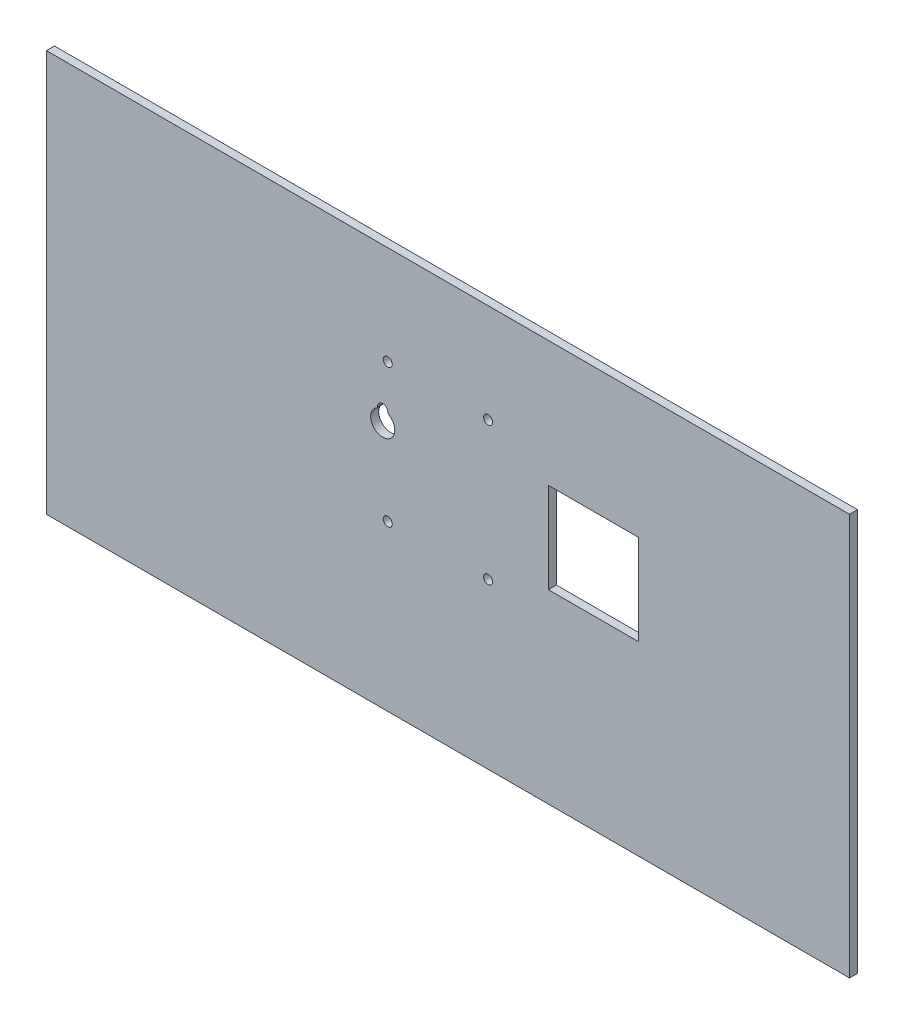
ISO-10303-21;
HEADER;
FILE_DESCRIPTION(('STEP AP214'),'2;1');
FILE_NAME('part.step','',(''),(''),'','','');
FILE_SCHEMA(('AUTOMOTIVE_DESIGN { 1 0 10303 214 1 1 1 1 }'));
ENDSEC;
DATA;
#1=APPLICATION_CONTEXT('core data for automotive mechanical design processes');
#2=APPLICATION_PROTOCOL_DEFINITION('international standard','automotive_design',2000,#1);
#3=PRODUCT_CONTEXT('',#1,'mechanical');
#4=PRODUCT('Part','Part','',(#3));
#5=PRODUCT_RELATED_PRODUCT_CATEGORY('part','',(#4));
#6=PRODUCT_DEFINITION_FORMATION('','',#4);
#7=PRODUCT_DEFINITION_CONTEXT('part definition',#1,'design');
#8=PRODUCT_DEFINITION('design','',#6,#7);
#9=PRODUCT_DEFINITION_SHAPE('','',#8);
#10=(LENGTH_UNIT() NAMED_UNIT(*) SI_UNIT(.MILLI.,.METRE.));
#11=(NAMED_UNIT(*) PLANE_ANGLE_UNIT() SI_UNIT($,.RADIAN.));
#12=(NAMED_UNIT(*) SI_UNIT($,.STERADIAN.) SOLID_ANGLE_UNIT());
#13=UNCERTAINTY_MEASURE_WITH_UNIT(LENGTH_MEASURE(1.E-05),#10,'distance_accuracy_value','');
#14=(GEOMETRIC_REPRESENTATION_CONTEXT(3) GLOBAL_UNCERTAINTY_ASSIGNED_CONTEXT((#13)) GLOBAL_UNIT_ASSIGNED_CONTEXT((#10,
#11,#12)) REPRESENTATION_CONTEXT('',''));
#15=CARTESIAN_POINT('',(0.,0.,0.));
#16=DIRECTION('',(0.,0.,1.));
#17=DIRECTION('',(1.,0.,0.));
#18=AXIS2_PLACEMENT_3D('',#15,#16,#17);
#19=CARTESIAN_POINT('',(295.,137.5,0.));
#20=DIRECTION('',(1.,0.,0.));
#21=DIRECTION('',(0.,0.,-1.));
#22=AXIS2_PLACEMENT_3D('',#19,#20,#21);
#23=PLANE('',#22);
#24=DIRECTION('',(0.,1.,0.));
#25=VECTOR('',#24,1.);
#26=CARTESIAN_POINT('',(295.,137.5,4.));
#27=LINE('',#26,#25);
#28=CARTESIAN_POINT('',(295.,92.5000000000001,4.));
#29=VERTEX_POINT('',#28);
#30=CARTESIAN_POINT('',(295.,137.5,4.));
#31=VERTEX_POINT('',#30);
#32=EDGE_CURVE('E213',#29,#31,#27,.T.);
#33=ORIENTED_EDGE('',*,*,#32,.T.);
#34=DIRECTION('',(0.,0.,1.));
#35=VECTOR('',#34,1.);
#36=CARTESIAN_POINT('',(295.,137.5,0.));
#37=LINE('',#36,#35);
#38=CARTESIAN_POINT('',(295.,137.5,0.));
#39=VERTEX_POINT('',#38);
#40=EDGE_CURVE('E229',#39,#31,#37,.T.);
#41=ORIENTED_EDGE('',*,*,#40,.F.);
#42=DIRECTION('',(0.,1.,0.));
#43=VECTOR('',#42,1.);
#44=CARTESIAN_POINT('',(295.,137.5,0.));
#45=LINE('',#44,#43);
#46=CARTESIAN_POINT('',(295.,92.5000000000001,0.));
#47=VERTEX_POINT('',#46);
#48=EDGE_CURVE('E216',#47,#39,#45,.T.);
#49=ORIENTED_EDGE('',*,*,#48,.F.);
#50=DIRECTION('',(0.,0.,1.));
#51=VECTOR('',#50,1.);
#52=CARTESIAN_POINT('',(295.,92.5000000000001,0.));
#53=LINE('',#52,#51);
#54=EDGE_CURVE('E239',#47,#29,#53,.T.);
#55=ORIENTED_EDGE('',*,*,#54,.T.);
#56=EDGE_LOOP('',(#33,#41,#49,#55));
#57=FACE_BOUND('',#56,.T.);
#58=ADVANCED_FACE('F36',(#57),#23,.F.);
#59=CARTESIAN_POINT('',(295.,92.5000000000001,0.));
#60=DIRECTION('',(0.,-1.,0.));
#61=DIRECTION('',(1.,0.,0.));
#62=AXIS2_PLACEMENT_3D('',#59,#60,#61);
#63=PLANE('',#62);
#64=DIRECTION('',(1.,0.,0.));
#65=VECTOR('',#64,1.);
#66=CARTESIAN_POINT('',(295.,92.5000000000001,4.));
#67=LINE('',#66,#65);
#68=CARTESIAN_POINT('',(250.,92.5,4.));
#69=VERTEX_POINT('',#68);
#70=EDGE_CURVE('E220',#69,#29,#67,.T.);
#71=ORIENTED_EDGE('',*,*,#70,.T.);
#72=ORIENTED_EDGE('',*,*,#54,.F.);
#73=DIRECTION('',(1.,0.,0.));
#74=VECTOR('',#73,1.);
#75=CARTESIAN_POINT('',(295.,92.5000000000001,0.));
#76=LINE('',#75,#74);
#77=CARTESIAN_POINT('',(250.,92.5,0.));
#78=VERTEX_POINT('',#77);
#79=EDGE_CURVE('E226',#78,#47,#76,.T.);
#80=ORIENTED_EDGE('',*,*,#79,.F.);
#81=DIRECTION('',(0.,0.,1.));
#82=VECTOR('',#81,1.);
#83=CARTESIAN_POINT('',(250.,92.5,0.));
#84=LINE('',#83,#82);
#85=EDGE_CURVE('E241',#78,#69,#84,.T.);
#86=ORIENTED_EDGE('',*,*,#85,.T.);
#87=EDGE_LOOP('',(#71,#72,#80,#86));
#88=FACE_BOUND('',#87,.T.);
#89=ADVANCED_FACE('F263',(#88),#63,.F.);
#90=CARTESIAN_POINT('',(250.,137.5,0.));
#91=DIRECTION('',(-1.,0.,0.));
#92=DIRECTION('',(0.,-1.,0.));
#93=AXIS2_PLACEMENT_3D('',#90,#91,#92);
#94=PLANE('',#93);
#95=DIRECTION('',(0.,-1.,0.));
#96=VECTOR('',#95,1.);
#97=CARTESIAN_POINT('',(250.,137.5,4.));
#98=LINE('',#97,#96);
#99=CARTESIAN_POINT('',(250.,137.5,4.));
#100=VERTEX_POINT('',#99);
#101=EDGE_CURVE('E234',#100,#69,#98,.T.);
#102=ORIENTED_EDGE('',*,*,#101,.T.);
#103=ORIENTED_EDGE('',*,*,#85,.F.);
#104=DIRECTION('',(0.,-1.,0.));
#105=VECTOR('',#104,1.);
#106=CARTESIAN_POINT('',(250.,137.5,0.));
#107=LINE('',#106,#105);
#108=CARTESIAN_POINT('',(250.,137.5,0.));
#109=VERTEX_POINT('',#108);
#110=EDGE_CURVE('E223',#109,#78,#107,.T.);
#111=ORIENTED_EDGE('',*,*,#110,.F.);
#112=DIRECTION('',(0.,0.,1.));
#113=VECTOR('',#112,1.);
#114=CARTESIAN_POINT('',(250.,137.5,0.));
#115=LINE('',#114,#113);
#116=EDGE_CURVE('E243',#109,#100,#115,.T.);
#117=ORIENTED_EDGE('',*,*,#116,.T.);
#118=EDGE_LOOP('',(#102,#103,#111,#117));
#119=FACE_BOUND('',#118,.T.);
#120=ADVANCED_FACE('F258',(#119),#94,.F.);
#121=CARTESIAN_POINT('',(295.,137.5,0.));
#122=DIRECTION('',(0.,1.,0.));
#123=DIRECTION('',(-1.,0.,0.));
#124=AXIS2_PLACEMENT_3D('',#121,#122,#123);
#125=PLANE('',#124);
#126=DIRECTION('',(-1.,0.,0.));
#127=VECTOR('',#126,1.);
#128=CARTESIAN_POINT('',(295.,137.5,4.));
#129=LINE('',#128,#127);
#130=EDGE_CURVE('E231',#31,#100,#129,.T.);
#131=ORIENTED_EDGE('',*,*,#130,.T.);
#132=ORIENTED_EDGE('',*,*,#116,.F.);
#133=DIRECTION('',(-1.,0.,0.));
#134=VECTOR('',#133,1.);
#135=CARTESIAN_POINT('',(295.,137.5,0.));
#136=LINE('',#135,#134);
#137=EDGE_CURVE('E219',#39,#109,#136,.T.);
#138=ORIENTED_EDGE('',*,*,#137,.F.);
#139=ORIENTED_EDGE('',*,*,#40,.T.);
#140=EDGE_LOOP('',(#131,#132,#138,#139));
#141=FACE_BOUND('',#140,.T.);
#142=ADVANCED_FACE('F249',(#141),#125,.F.);
#143=CARTESIAN_POINT('',(220.,150.75,0.));
#144=DIRECTION('',(0.,0.,1.));
#145=DIRECTION('',(1.,0.,0.));
#146=AXIS2_PLACEMENT_3D('',#143,#144,#145);
#147=CYLINDRICAL_SURFACE('',#146,2.25000000000001);
#148=CARTESIAN_POINT('',(220.,150.75,0.));
#149=DIRECTION('',(0.,0.,1.));
#150=DIRECTION('',(1.,0.,0.));
#151=AXIS2_PLACEMENT_3D('',#148,#149,#150);
#152=CIRCLE('',#151,2.25000000000001);
#153=CARTESIAN_POINT('',(222.25,150.75,0.));
#154=VERTEX_POINT('',#153);
#155=EDGE_CURVE('E210',#154,#154,#152,.T.);
#156=ORIENTED_EDGE('',*,*,#155,.F.);
#157=EDGE_LOOP('',(#156));
#158=FACE_BOUND('',#157,.T.);
#159=CARTESIAN_POINT('',(220.,150.75,4.));
#160=DIRECTION('',(0.,0.,1.));
#161=DIRECTION('',(1.,0.,0.));
#162=AXIS2_PLACEMENT_3D('',#159,#160,#161);
#163=CIRCLE('',#162,2.25000000000001);
#164=CARTESIAN_POINT('',(222.25,150.75,4.));
#165=VERTEX_POINT('',#164);
#166=EDGE_CURVE('E207',#165,#165,#163,.T.);
#167=ORIENTED_EDGE('',*,*,#166,.T.);
#168=EDGE_LOOP('',(#167));
#169=FACE_BOUND('',#168,.T.);
#170=ADVANCED_FACE('F273',(#158,#169),#147,.F.);
#171=CARTESIAN_POINT('',(170.,150.75,0.));
#172=DIRECTION('',(0.,0.,1.));
#173=DIRECTION('',(1.,0.,0.));
#174=AXIS2_PLACEMENT_3D('',#171,#172,#173);
#175=CYLINDRICAL_SURFACE('',#174,2.25);
#176=CARTESIAN_POINT('',(170.,150.75,0.));
#177=DIRECTION('',(0.,0.,1.));
#178=DIRECTION('',(1.,0.,0.));
#179=AXIS2_PLACEMENT_3D('',#176,#177,#178);
#180=CIRCLE('',#179,2.25);
#181=CARTESIAN_POINT('',(172.25,150.75,0.));
#182=VERTEX_POINT('',#181);
#183=EDGE_CURVE('E204',#182,#182,#180,.T.);
#184=ORIENTED_EDGE('',*,*,#183,.F.);
#185=EDGE_LOOP('',(#184));
#186=FACE_BOUND('',#185,.T.);
#187=CARTESIAN_POINT('',(170.,150.75,4.));
#188=DIRECTION('',(0.,0.,1.));
#189=DIRECTION('',(1.,0.,0.));
#190=AXIS2_PLACEMENT_3D('',#187,#188,#189);
#191=CIRCLE('',#190,2.25);
#192=CARTESIAN_POINT('',(172.25,150.75,4.));
#193=VERTEX_POINT('',#192);
#194=EDGE_CURVE('E201',#193,#193,#191,.T.);
#195=ORIENTED_EDGE('',*,*,#194,.T.);
#196=EDGE_LOOP('',(#195));
#197=FACE_BOUND('',#196,.T.);
#198=ADVANCED_FACE('F296',(#186,#197),#175,.F.);
#199=CARTESIAN_POINT('',(220.,81.91754989,0.));
#200=DIRECTION('',(0.,0.,1.));
#201=DIRECTION('',(1.,0.,0.));
#202=AXIS2_PLACEMENT_3D('',#199,#200,#201);
#203=CYLINDRICAL_SURFACE('',#202,2.25000000000001);
#204=CARTESIAN_POINT('',(220.,81.91754989,0.));
#205=DIRECTION('',(0.,0.,1.));
#206=DIRECTION('',(1.,0.,0.));
#207=AXIS2_PLACEMENT_3D('',#204,#205,#206);
#208=CIRCLE('',#207,2.25000000000001);
#209=CARTESIAN_POINT('',(222.25,81.91754989,0.));
#210=VERTEX_POINT('',#209);
#211=EDGE_CURVE('E198',#210,#210,#208,.T.);
#212=ORIENTED_EDGE('',*,*,#211,.F.);
#213=EDGE_LOOP('',(#212));
#214=FACE_BOUND('',#213,.T.);
#215=CARTESIAN_POINT('',(220.,81.91754989,4.));
#216=DIRECTION('',(0.,0.,1.));
#217=DIRECTION('',(1.,0.,0.));
#218=AXIS2_PLACEMENT_3D('',#215,#216,#217);
#219=CIRCLE('',#218,2.25000000000001);
#220=CARTESIAN_POINT('',(222.25,81.91754989,4.));
#221=VERTEX_POINT('',#220);
#222=EDGE_CURVE('E195',#221,#221,#219,.T.);
#223=ORIENTED_EDGE('',*,*,#222,.T.);
#224=EDGE_LOOP('',(#223));
#225=FACE_BOUND('',#224,.T.);
#226=ADVANCED_FACE('F302',(#214,#225),#203,.F.);
#227=CARTESIAN_POINT('',(170.,81.91754989,0.));
#228=DIRECTION('',(0.,0.,1.));
#229=DIRECTION('',(1.,0.,0.));
#230=AXIS2_PLACEMENT_3D('',#227,#228,#229);
#231=CYLINDRICAL_SURFACE('',#230,2.25000000000001);
#232=CARTESIAN_POINT('',(170.,81.91754989,0.));
#233=DIRECTION('',(0.,0.,1.));
#234=DIRECTION('',(1.,0.,0.));
#235=AXIS2_PLACEMENT_3D('',#232,#233,#234);
#236=CIRCLE('',#235,2.25000000000001);
#237=CARTESIAN_POINT('',(172.25,81.91754989,0.));
#238=VERTEX_POINT('',#237);
#239=EDGE_CURVE('E192',#238,#238,#236,.T.);
#240=ORIENTED_EDGE('',*,*,#239,.F.);
#241=EDGE_LOOP('',(#240));
#242=FACE_BOUND('',#241,.T.);
#243=CARTESIAN_POINT('',(170.,81.91754989,4.));
#244=DIRECTION('',(0.,0.,1.));
#245=DIRECTION('',(1.,0.,0.));
#246=AXIS2_PLACEMENT_3D('',#243,#244,#245);
#247=CIRCLE('',#246,2.25000000000001);
#248=CARTESIAN_POINT('',(172.25,81.91754989,4.));
#249=VERTEX_POINT('',#248);
#250=EDGE_CURVE('E186',#249,#249,#247,.T.);
#251=ORIENTED_EDGE('',*,*,#250,.T.);
#252=EDGE_LOOP('',(#251));
#253=FACE_BOUND('',#252,.T.);
#254=ADVANCED_FACE('F307',(#242,#253),#231,.F.);
#255=CARTESIAN_POINT('',(163.950154547818,129.033125,0.));
#256=DIRECTION('',(0.,0.,1.));
#257=DIRECTION('',(1.,0.,0.));
#258=AXIS2_PLACEMENT_3D('',#255,#256,#257);
#259=CYLINDRICAL_SURFACE('',#258,1.);
#260=CARTESIAN_POINT('',(163.950154547818,129.033125,4.));
#261=DIRECTION('',(0.,0.,-1.));
#262=DIRECTION('',(-1.,0.,0.));
#263=AXIS2_PLACEMENT_3D('',#260,#261,#262);
#264=CIRCLE('',#263,1.);
#265=CARTESIAN_POINT('',(164.950111013222,129.023794014085,4.));
#266=VERTEX_POINT('',#265);
#267=CARTESIAN_POINT('',(164.457275326701,128.17125,4.));
#268=VERTEX_POINT('',#267);
#269=EDGE_CURVE('E59',#266,#268,#264,.T.);
#270=ORIENTED_EDGE('',*,*,#269,.T.);
#271=DIRECTION('',(0.,0.,1.));
#272=VECTOR('',#271,1.);
#273=CARTESIAN_POINT('',(164.457275326701,128.17125,0.));
#274=LINE('',#273,#272);
#275=CARTESIAN_POINT('',(164.457275326701,128.17125,0.));
#276=VERTEX_POINT('',#275);
#277=EDGE_CURVE('E174',#276,#268,#274,.T.);
#278=ORIENTED_EDGE('',*,*,#277,.F.);
#279=CARTESIAN_POINT('',(163.950154547818,129.033125,0.));
#280=DIRECTION('',(0.,0.,-1.));
#281=DIRECTION('',(-1.,0.,0.));
#282=AXIS2_PLACEMENT_3D('',#279,#280,#281);
#283=CIRCLE('',#282,1.);
#284=CARTESIAN_POINT('',(164.950111013222,129.023794014085,0.));
#285=VERTEX_POINT('',#284);
#286=EDGE_CURVE('E163',#285,#276,#283,.T.);
#287=ORIENTED_EDGE('',*,*,#286,.F.);
#288=DIRECTION('',(0.,0.,1.));
#289=VECTOR('',#288,1.);
#290=CARTESIAN_POINT('',(164.950111013222,129.023794014085,0.));
#291=LINE('',#290,#289);
#292=EDGE_CURVE('E184',#285,#266,#291,.T.);
#293=ORIENTED_EDGE('',*,*,#292,.T.);
#294=EDGE_LOOP('',(#270,#278,#287,#293));
#295=FACE_BOUND('',#294,.T.);
#296=ADVANCED_FACE('F314',(#295),#259,.T.);
#297=CARTESIAN_POINT('',(167.5,129.,0.));
#298=DIRECTION('',(0.,0.,1.));
#299=DIRECTION('',(1.,0.,0.));
#300=AXIS2_PLACEMENT_3D('',#297,#298,#299);
#301=CYLINDRICAL_SURFACE('',#300,2.54999999999999);
#302=CARTESIAN_POINT('',(167.5,129.,4.));
#303=DIRECTION('',(0.,0.,1.));
#304=DIRECTION('',(1.,0.,0.));
#305=AXIS2_PLACEMENT_3D('',#302,#303,#304);
#306=CIRCLE('',#305,2.54999999999999);
#307=CARTESIAN_POINT('',(170.049888986778,129.023794014085,4.));
#308=VERTEX_POINT('',#307);
#309=EDGE_CURVE('E167',#308,#266,#306,.T.);
#310=ORIENTED_EDGE('',*,*,#309,.T.);
#311=ORIENTED_EDGE('',*,*,#292,.F.);
#312=CARTESIAN_POINT('',(167.5,129.,0.));
#313=DIRECTION('',(0.,0.,1.));
#314=DIRECTION('',(1.,0.,0.));
#315=AXIS2_PLACEMENT_3D('',#312,#313,#314);
#316=CIRCLE('',#315,2.54999999999999);
#317=CARTESIAN_POINT('',(170.049888986778,129.023794014085,0.));
#318=VERTEX_POINT('',#317);
#319=EDGE_CURVE('E171',#318,#285,#316,.T.);
#320=ORIENTED_EDGE('',*,*,#319,.F.);
#321=DIRECTION('',(0.,0.,1.));
#322=VECTOR('',#321,1.);
#323=CARTESIAN_POINT('',(170.049888986778,129.023794014085,0.));
#324=LINE('',#323,#322);
#325=EDGE_CURVE('E187',#318,#308,#324,.T.);
#326=ORIENTED_EDGE('',*,*,#325,.T.);
#327=EDGE_LOOP('',(#310,#311,#320,#326));
#328=FACE_BOUND('',#327,.T.);
#329=ADVANCED_FACE('F318',(#328),#301,.F.);
#330=CARTESIAN_POINT('',(171.049845452182,129.033125,0.));
#331=DIRECTION('',(0.,0.,1.));
#332=DIRECTION('',(1.,0.,0.));
#333=AXIS2_PLACEMENT_3D('',#330,#331,#332);
#334=CYLINDRICAL_SURFACE('',#333,1.);
#335=CARTESIAN_POINT('',(171.049845452182,129.033125,4.));
#336=DIRECTION('',(0.,0.,-1.));
#337=DIRECTION('',(1.,0.,0.));
#338=AXIS2_PLACEMENT_3D('',#335,#336,#337);
#339=CIRCLE('',#338,1.);
#340=CARTESIAN_POINT('',(170.542724673299,128.17125,4.));
#341=VERTEX_POINT('',#340);
#342=EDGE_CURVE('E179',#341,#308,#339,.T.);
#343=ORIENTED_EDGE('',*,*,#342,.T.);
#344=ORIENTED_EDGE('',*,*,#325,.F.);
#345=CARTESIAN_POINT('',(171.049845452182,129.033125,0.));
#346=DIRECTION('',(0.,0.,-1.));
#347=DIRECTION('',(1.,0.,0.));
#348=AXIS2_PLACEMENT_3D('',#345,#346,#347);
#349=CIRCLE('',#348,1.);
#350=CARTESIAN_POINT('',(170.542724673299,128.17125,0.));
#351=VERTEX_POINT('',#350);
#352=EDGE_CURVE('E51',#351,#318,#349,.T.);
#353=ORIENTED_EDGE('',*,*,#352,.F.);
#354=DIRECTION('',(0.,0.,1.));
#355=VECTOR('',#354,1.);
#356=CARTESIAN_POINT('',(170.542724673299,128.17125,0.));
#357=LINE('',#356,#355);
#358=EDGE_CURVE('E189',#351,#341,#357,.T.);
#359=ORIENTED_EDGE('',*,*,#358,.T.);
#360=EDGE_LOOP('',(#343,#344,#353,#359));
#361=FACE_BOUND('',#360,.T.);
#362=ADVANCED_FACE('F323',(#361),#334,.T.);
#363=CARTESIAN_POINT('',(167.5,123.,0.));
#364=DIRECTION('',(0.,0.,1.));
#365=DIRECTION('',(1.,0.,0.));
#366=AXIS2_PLACEMENT_3D('',#363,#364,#365);
#367=CYLINDRICAL_SURFACE('',#366,6.00000000000002);
#368=CARTESIAN_POINT('',(167.5,123.,4.));
#369=DIRECTION('',(0.,0.,1.));
#370=DIRECTION('',(1.,0.,0.));
#371=AXIS2_PLACEMENT_3D('',#368,#369,#370);
#372=CIRCLE('',#371,6.00000000000002);
#373=EDGE_CURVE('E176',#268,#341,#372,.T.);
#374=ORIENTED_EDGE('',*,*,#373,.T.);
#375=ORIENTED_EDGE('',*,*,#358,.F.);
#376=CARTESIAN_POINT('',(167.5,123.,0.));
#377=DIRECTION('',(0.,0.,1.));
#378=DIRECTION('',(1.,0.,0.));
#379=AXIS2_PLACEMENT_3D('',#376,#377,#378);
#380=CIRCLE('',#379,6.00000000000002);
#381=EDGE_CURVE('E166',#276,#351,#380,.T.);
#382=ORIENTED_EDGE('',*,*,#381,.F.);
#383=ORIENTED_EDGE('',*,*,#277,.T.);
#384=EDGE_LOOP('',(#374,#375,#382,#383));
#385=FACE_BOUND('',#384,.T.);
#386=ADVANCED_FACE('F319',(#385),#367,.F.);
#387=CARTESIAN_POINT('',(400.,200.,4.));
#388=DIRECTION('',(-1.,0.,0.));
#389=DIRECTION('',(0.,0.,1.));
#390=AXIS2_PLACEMENT_3D('',#387,#388,#389);
#391=PLANE('',#390);
#392=DIRECTION('',(0.,1.,0.));
#393=VECTOR('',#392,1.);
#394=CARTESIAN_POINT('',(400.,200.,0.));
#395=LINE('',#394,#393);
#396=CARTESIAN_POINT('',(400.,0.,0.));
#397=VERTEX_POINT('',#396);
#398=CARTESIAN_POINT('',(400.,200.,0.));
#399=VERTEX_POINT('',#398);
#400=EDGE_CURVE('E140',#397,#399,#395,.T.);
#401=ORIENTED_EDGE('',*,*,#400,.T.);
#402=DIRECTION('',(0.,0.,-1.));
#403=VECTOR('',#402,1.);
#404=CARTESIAN_POINT('',(400.,200.,4.));
#405=LINE('',#404,#403);
#406=CARTESIAN_POINT('',(400.,200.,4.));
#407=VERTEX_POINT('',#406);
#408=EDGE_CURVE('E160',#407,#399,#405,.T.);
#409=ORIENTED_EDGE('',*,*,#408,.F.);
#410=DIRECTION('',(0.,1.,0.));
#411=VECTOR('',#410,1.);
#412=CARTESIAN_POINT('',(400.,200.,4.));
#413=LINE('',#412,#411);
#414=CARTESIAN_POINT('',(400.,0.,4.));
#415=VERTEX_POINT('',#414);
#416=EDGE_CURVE('E150',#415,#407,#413,.T.);
#417=ORIENTED_EDGE('',*,*,#416,.F.);
#418=DIRECTION('',(0.,0.,-1.));
#419=VECTOR('',#418,1.);
#420=CARTESIAN_POINT('',(400.,0.,4.));
#421=LINE('',#420,#419);
#422=EDGE_CURVE('E141',#415,#397,#421,.T.);
#423=ORIENTED_EDGE('',*,*,#422,.T.);
#424=EDGE_LOOP('',(#401,#409,#417,#423));
#425=FACE_BOUND('',#424,.T.);
#426=ADVANCED_FACE('F322',(#425),#391,.F.);
#427=CARTESIAN_POINT('',(400.,200.,4.));
#428=DIRECTION('',(0.,-1.,0.));
#429=DIRECTION('',(1.,0.,0.));
#430=AXIS2_PLACEMENT_3D('',#427,#428,#429);
#431=PLANE('',#430);
#432=DIRECTION('',(-1.,0.,0.));
#433=VECTOR('',#432,1.);
#434=CARTESIAN_POINT('',(400.,200.,0.));
#435=LINE('',#434,#433);
#436=CARTESIAN_POINT('',(0.,200.,0.));
#437=VERTEX_POINT('',#436);
#438=EDGE_CURVE('E152',#399,#437,#435,.T.);
#439=ORIENTED_EDGE('',*,*,#438,.T.);
#440=DIRECTION('',(0.,0.,-1.));
#441=VECTOR('',#440,1.);
#442=CARTESIAN_POINT('',(0.,200.,4.));
#443=LINE('',#442,#441);
#444=CARTESIAN_POINT('',(0.,200.,4.));
#445=VERTEX_POINT('',#444);
#446=EDGE_CURVE('E154',#445,#437,#443,.T.);
#447=ORIENTED_EDGE('',*,*,#446,.F.);
#448=DIRECTION('',(-1.,0.,0.));
#449=VECTOR('',#448,1.);
#450=CARTESIAN_POINT('',(400.,200.,4.));
#451=LINE('',#450,#449);
#452=EDGE_CURVE('E131',#407,#445,#451,.T.);
#453=ORIENTED_EDGE('',*,*,#452,.F.);
#454=ORIENTED_EDGE('',*,*,#408,.T.);
#455=EDGE_LOOP('',(#439,#447,#453,#454));
#456=FACE_BOUND('',#455,.T.);
#457=ADVANCED_FACE('F332',(#456),#431,.F.);
#458=CARTESIAN_POINT('',(400.,0.,4.));
#459=DIRECTION('',(0.,1.,0.));
#460=DIRECTION('',(-1.,0.,0.));
#461=AXIS2_PLACEMENT_3D('',#458,#459,#460);
#462=PLANE('',#461);
#463=DIRECTION('',(1.,0.,0.));
#464=VECTOR('',#463,1.);
#465=CARTESIAN_POINT('',(400.,0.,0.));
#466=LINE('',#465,#464);
#467=CARTESIAN_POINT('',(0.,0.,0.));
#468=VERTEX_POINT('',#467);
#469=EDGE_CURVE('E145',#468,#397,#466,.T.);
#470=ORIENTED_EDGE('',*,*,#469,.T.);
#471=ORIENTED_EDGE('',*,*,#422,.F.);
#472=DIRECTION('',(1.,0.,0.));
#473=VECTOR('',#472,1.);
#474=CARTESIAN_POINT('',(400.,0.,4.));
#475=LINE('',#474,#473);
#476=CARTESIAN_POINT('',(0.,0.,4.));
#477=VERTEX_POINT('',#476);
#478=EDGE_CURVE('E129',#477,#415,#475,.T.);
#479=ORIENTED_EDGE('',*,*,#478,.F.);
#480=DIRECTION('',(0.,0.,-1.));
#481=VECTOR('',#480,1.);
#482=CARTESIAN_POINT('',(0.,0.,4.));
#483=LINE('',#482,#481);
#484=EDGE_CURVE('E136',#477,#468,#483,.T.);
#485=ORIENTED_EDGE('',*,*,#484,.T.);
#486=EDGE_LOOP('',(#470,#471,#479,#485));
#487=FACE_BOUND('',#486,.T.);
#488=ADVANCED_FACE('F143',(#487),#462,.F.);
#489=CARTESIAN_POINT('',(0.,175.,4.));
#490=DIRECTION('',(1.,0.,0.));
#491=DIRECTION('',(0.,1.,0.));
#492=AXIS2_PLACEMENT_3D('',#489,#490,#491);
#493=PLANE('',#492);
#494=DIRECTION('',(0.,-1.,0.));
#495=VECTOR('',#494,1.);
#496=CARTESIAN_POINT('',(0.,175.,0.));
#497=LINE('',#496,#495);
#498=EDGE_CURVE('E40',#437,#468,#497,.T.);
#499=ORIENTED_EDGE('',*,*,#498,.T.);
#500=ORIENTED_EDGE('',*,*,#484,.F.);
#501=DIRECTION('',(0.,-1.,0.));
#502=VECTOR('',#501,1.);
#503=CARTESIAN_POINT('',(0.,175.,4.));
#504=LINE('',#503,#502);
#505=EDGE_CURVE('E11',#445,#477,#504,.T.);
#506=ORIENTED_EDGE('',*,*,#505,.F.);
#507=ORIENTED_EDGE('',*,*,#446,.T.);
#508=EDGE_LOOP('',(#499,#500,#506,#507));
#509=FACE_BOUND('',#508,.T.);
#510=ADVANCED_FACE('F38',(#509),#493,.F.);
#511=CARTESIAN_POINT('',(0.,25.0000000000005,4.));
#512=DIRECTION('',(0.,0.,-1.));
#513=DIRECTION('',(-1.,0.,0.));
#514=AXIS2_PLACEMENT_3D('',#511,#512,#513);
#515=PLANE('',#514);
#516=ORIENTED_EDGE('',*,*,#452,.T.);
#517=ORIENTED_EDGE('',*,*,#505,.T.);
#518=ORIENTED_EDGE('',*,*,#478,.T.);
#519=ORIENTED_EDGE('',*,*,#416,.T.);
#520=EDGE_LOOP('',(#516,#517,#518,#519));
#521=FACE_BOUND('',#520,.T.);
#522=ORIENTED_EDGE('',*,*,#373,.F.);
#523=ORIENTED_EDGE('',*,*,#269,.F.);
#524=ORIENTED_EDGE('',*,*,#309,.F.);
#525=ORIENTED_EDGE('',*,*,#342,.F.);
#526=EDGE_LOOP('',(#522,#523,#524,#525));
#527=FACE_BOUND('',#526,.T.);
#528=ORIENTED_EDGE('',*,*,#250,.F.);
#529=EDGE_LOOP('',(#528));
#530=FACE_BOUND('',#529,.T.);
#531=ORIENTED_EDGE('',*,*,#222,.F.);
#532=EDGE_LOOP('',(#531));
#533=FACE_BOUND('',#532,.T.);
#534=ORIENTED_EDGE('',*,*,#194,.F.);
#535=EDGE_LOOP('',(#534));
#536=FACE_BOUND('',#535,.T.);
#537=ORIENTED_EDGE('',*,*,#166,.F.);
#538=EDGE_LOOP('',(#537));
#539=FACE_BOUND('',#538,.T.);
#540=ORIENTED_EDGE('',*,*,#130,.F.);
#541=ORIENTED_EDGE('',*,*,#32,.F.);
#542=ORIENTED_EDGE('',*,*,#70,.F.);
#543=ORIENTED_EDGE('',*,*,#101,.F.);
#544=EDGE_LOOP('',(#540,#541,#542,#543));
#545=FACE_BOUND('',#544,.T.);
#546=ADVANCED_FACE('F125',(#521,#527,#530,#533,#536,#539,#545),#515,.F.);
#547=CARTESIAN_POINT('',(0.,25.0000000000005,0.));
#548=DIRECTION('',(0.,0.,-1.));
#549=DIRECTION('',(-1.,0.,0.));
#550=AXIS2_PLACEMENT_3D('',#547,#548,#549);
#551=PLANE('',#550);
#552=ORIENTED_EDGE('',*,*,#498,.F.);
#553=ORIENTED_EDGE('',*,*,#438,.F.);
#554=ORIENTED_EDGE('',*,*,#400,.F.);
#555=ORIENTED_EDGE('',*,*,#469,.F.);
#556=EDGE_LOOP('',(#552,#553,#554,#555));
#557=FACE_BOUND('',#556,.T.);
#558=ORIENTED_EDGE('',*,*,#286,.T.);
#559=ORIENTED_EDGE('',*,*,#381,.T.);
#560=ORIENTED_EDGE('',*,*,#352,.T.);
#561=ORIENTED_EDGE('',*,*,#319,.T.);
#562=EDGE_LOOP('',(#558,#559,#560,#561));
#563=FACE_BOUND('',#562,.T.);
#564=ORIENTED_EDGE('',*,*,#239,.T.);
#565=EDGE_LOOP('',(#564));
#566=FACE_BOUND('',#565,.T.);
#567=ORIENTED_EDGE('',*,*,#211,.T.);
#568=EDGE_LOOP('',(#567));
#569=FACE_BOUND('',#568,.T.);
#570=ORIENTED_EDGE('',*,*,#183,.T.);
#571=EDGE_LOOP('',(#570));
#572=FACE_BOUND('',#571,.T.);
#573=ORIENTED_EDGE('',*,*,#155,.T.);
#574=EDGE_LOOP('',(#573));
#575=FACE_BOUND('',#574,.T.);
#576=ORIENTED_EDGE('',*,*,#48,.T.);
#577=ORIENTED_EDGE('',*,*,#137,.T.);
#578=ORIENTED_EDGE('',*,*,#110,.T.);
#579=ORIENTED_EDGE('',*,*,#79,.T.);
#580=EDGE_LOOP('',(#576,#577,#578,#579));
#581=FACE_BOUND('',#580,.T.);
#582=ADVANCED_FACE('F261',(#557,#563,#566,#569,#572,#575,#581),#551,.T.);
#583=CLOSED_SHELL('',(#58,#89,#120,#142,#170,#198,#226,#254,#296,#329,#362,#386,#426,#457,#488,
#510,#546,#582));
#584=MANIFOLD_SOLID_BREP('B2',#583);
#585=ADVANCED_BREP_SHAPE_REPRESENTATION('',(#18,#584),#14);
#586=SHAPE_DEFINITION_REPRESENTATION(#9,#585);
ENDSEC;
END-ISO-10303-21;
